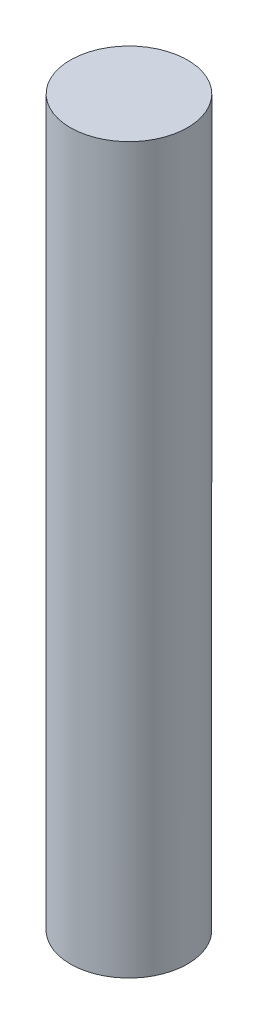
ISO-10303-21;
HEADER;
FILE_DESCRIPTION(('STEP AP214'),'2;1');
FILE_NAME('part.step','',(''),(''),'','','');
FILE_SCHEMA(('AUTOMOTIVE_DESIGN { 1 0 10303 214 1 1 1 1 }'));
ENDSEC;
DATA;
#1=APPLICATION_CONTEXT('core data for automotive mechanical design processes');
#2=APPLICATION_PROTOCOL_DEFINITION('international standard','automotive_design',2000,#1);
#3=PRODUCT_CONTEXT('',#1,'mechanical');
#4=PRODUCT('Part','Part','',(#3));
#5=PRODUCT_RELATED_PRODUCT_CATEGORY('part','',(#4));
#6=PRODUCT_DEFINITION_FORMATION('','',#4);
#7=PRODUCT_DEFINITION_CONTEXT('part definition',#1,'design');
#8=PRODUCT_DEFINITION('design','',#6,#7);
#9=PRODUCT_DEFINITION_SHAPE('','',#8);
#10=(LENGTH_UNIT() NAMED_UNIT(*) SI_UNIT(.MILLI.,.METRE.));
#11=(NAMED_UNIT(*) PLANE_ANGLE_UNIT() SI_UNIT($,.RADIAN.));
#12=(NAMED_UNIT(*) SI_UNIT($,.STERADIAN.) SOLID_ANGLE_UNIT());
#13=UNCERTAINTY_MEASURE_WITH_UNIT(LENGTH_MEASURE(1.E-05),#10,'distance_accuracy_value','');
#14=(GEOMETRIC_REPRESENTATION_CONTEXT(3) GLOBAL_UNCERTAINTY_ASSIGNED_CONTEXT((#13)) GLOBAL_UNIT_ASSIGNED_CONTEXT((#10,
#11,#12)) REPRESENTATION_CONTEXT('',''));
#15=CARTESIAN_POINT('',(0.,0.,0.));
#16=DIRECTION('',(0.,0.,1.));
#17=DIRECTION('',(1.,0.,0.));
#18=AXIS2_PLACEMENT_3D('',#15,#16,#17);
#19=CARTESIAN_POINT('',(0.,-520.,0.));
#20=DIRECTION('',(0.,1.,0.));
#21=DIRECTION('',(0.,0.,1.));
#22=AXIS2_PLACEMENT_3D('',#19,#20,#21);
#23=CYLINDRICAL_SURFACE('',#22,6.35);
#24=CARTESIAN_POINT('',(0.,80.,0.));
#25=DIRECTION('',(0.,1.,0.));
#26=DIRECTION('',(0.,0.,1.));
#27=AXIS2_PLACEMENT_3D('',#24,#25,#26);
#28=CIRCLE('',#27,6.35);
#29=CARTESIAN_POINT('',(0.,80.,6.35));
#30=VERTEX_POINT('',#29);
#31=EDGE_CURVE('E44',#30,#30,#28,.T.);
#32=ORIENTED_EDGE('',*,*,#31,.F.);
#33=EDGE_LOOP('',(#32));
#34=FACE_BOUND('',#33,.T.);
#35=CARTESIAN_POINT('',(0.,1.49999999999995,0.));
#36=DIRECTION('',(0.,-1.,0.));
#37=DIRECTION('',(0.,0.,-1.));
#38=AXIS2_PLACEMENT_3D('',#35,#36,#37);
#39=CIRCLE('',#38,6.35);
#40=CARTESIAN_POINT('',(0.,1.49999999999995,-6.35));
#41=VERTEX_POINT('',#40);
#42=EDGE_CURVE('E10',#41,#41,#39,.F.);
#43=ORIENTED_EDGE('',*,*,#42,.T.);
#44=EDGE_LOOP('',(#43));
#45=FACE_BOUND('',#44,.T.);
#46=ADVANCED_FACE('F37',(#34,#45),#23,.T.);
#47=CARTESIAN_POINT('',(0.,80.,0.));
#48=DIRECTION('',(0.,1.,0.));
#49=DIRECTION('',(0.,0.,1.));
#50=AXIS2_PLACEMENT_3D('',#47,#48,#49);
#51=PLANE('',#50);
#52=ORIENTED_EDGE('',*,*,#31,.T.);
#53=EDGE_LOOP('',(#52));
#54=FACE_BOUND('',#53,.T.);
#55=ADVANCED_FACE('F39',(#54),#51,.T.);
#56=CARTESIAN_POINT('',(7.,1.49999999999995,6.35));
#57=DIRECTION('',(0.,-1.,0.));
#58=DIRECTION('',(0.,0.,-1.));
#59=AXIS2_PLACEMENT_3D('',#56,#57,#58);
#60=PLANE('',#59);
#61=ORIENTED_EDGE('',*,*,#42,.F.);
#62=EDGE_LOOP('',(#61));
#63=FACE_BOUND('',#62,.T.);
#64=ADVANCED_FACE('F56',(#63),#60,.T.);
#65=CLOSED_SHELL('',(#46,#55,#64));
#66=MANIFOLD_SOLID_BREP('B2',#65);
#67=ADVANCED_BREP_SHAPE_REPRESENTATION('',(#18,#66),#14);
#68=SHAPE_DEFINITION_REPRESENTATION(#9,#67);
ENDSEC;
END-ISO-10303-21;
